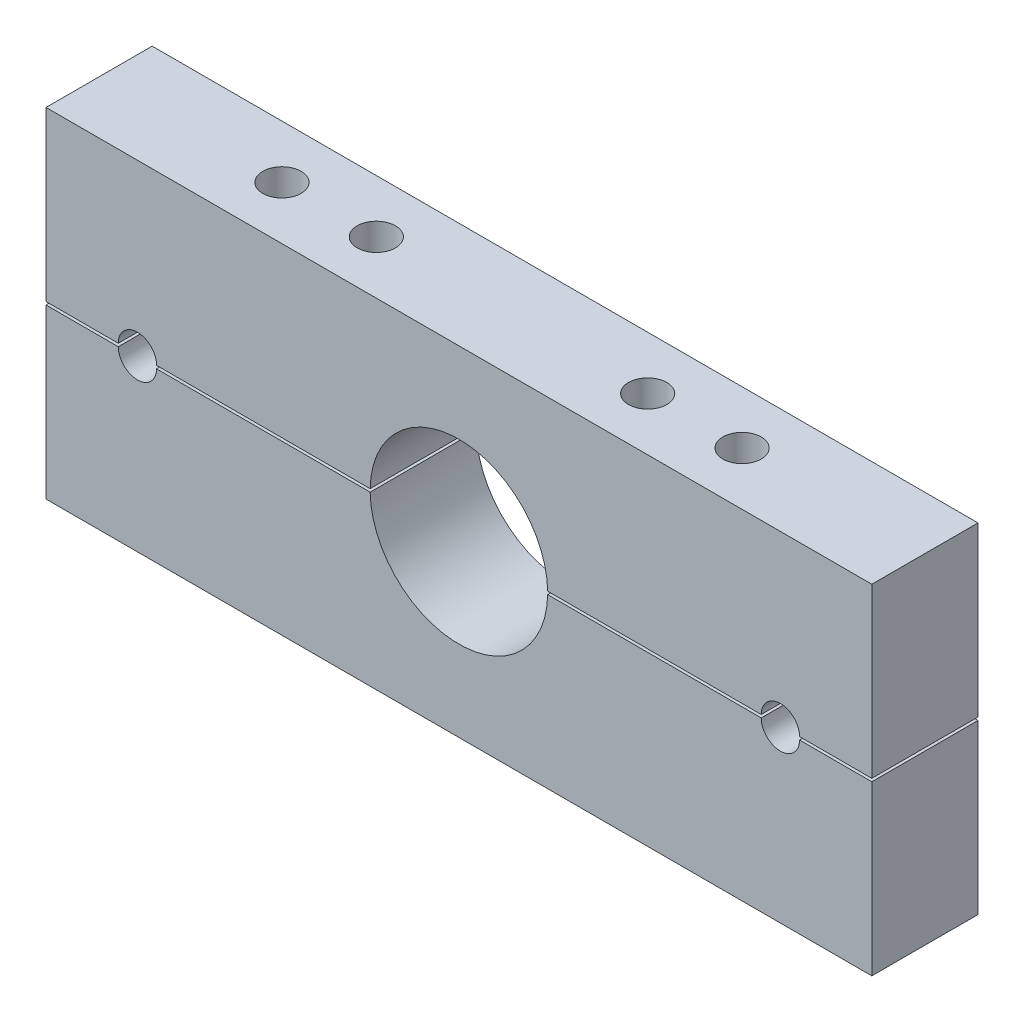
ISO-10303-21;
HEADER;
FILE_DESCRIPTION(('STEP AP214'),'2;1');
FILE_NAME('part.step','',(''),(''),'','','');
FILE_SCHEMA(('AUTOMOTIVE_DESIGN { 1 0 10303 214 1 1 1 1 }'));
ENDSEC;
DATA;
#1=APPLICATION_CONTEXT('core data for automotive mechanical design processes');
#2=APPLICATION_PROTOCOL_DEFINITION('international standard','automotive_design',2000,#1);
#3=PRODUCT_CONTEXT('',#1,'mechanical');
#4=PRODUCT('Part','Part','',(#3));
#5=PRODUCT_RELATED_PRODUCT_CATEGORY('part','',(#4));
#6=PRODUCT_DEFINITION_FORMATION('','',#4);
#7=PRODUCT_DEFINITION_CONTEXT('part definition',#1,'design');
#8=PRODUCT_DEFINITION('design','',#6,#7);
#9=PRODUCT_DEFINITION_SHAPE('','',#8);
#10=(LENGTH_UNIT() NAMED_UNIT(*) SI_UNIT(.MILLI.,.METRE.));
#11=(NAMED_UNIT(*) PLANE_ANGLE_UNIT() SI_UNIT($,.RADIAN.));
#12=(NAMED_UNIT(*) SI_UNIT($,.STERADIAN.) SOLID_ANGLE_UNIT());
#13=UNCERTAINTY_MEASURE_WITH_UNIT(LENGTH_MEASURE(1.E-05),#10,'distance_accuracy_value','');
#14=(GEOMETRIC_REPRESENTATION_CONTEXT(3) GLOBAL_UNCERTAINTY_ASSIGNED_CONTEXT((#13)) GLOBAL_UNIT_ASSIGNED_CONTEXT((#10,
#11,#12)) REPRESENTATION_CONTEXT('',''));
#15=CARTESIAN_POINT('',(0.,0.,0.));
#16=DIRECTION('',(0.,0.,1.));
#17=DIRECTION('',(1.,0.,0.));
#18=AXIS2_PLACEMENT_3D('',#15,#16,#17);
#19=CARTESIAN_POINT('',(267.829500207352,-141.519656459711,0.));
#20=DIRECTION('',(0.,1.,0.));
#21=DIRECTION('',(-1.,0.,0.));
#22=AXIS2_PLACEMENT_3D('',#19,#20,#21);
#23=PLANE('',#22);
#24=CARTESIAN_POINT('',(205.829500207352,-141.519656459711,18.));
#25=DIRECTION('',(0.,1.,0.));
#26=DIRECTION('',(-1.,0.,0.));
#27=AXIS2_PLACEMENT_3D('',#24,#25,#26);
#28=CIRCLE('',#27,6.50000000000002);
#29=CARTESIAN_POINT('',(199.329500207352,-141.519656459711,18.));
#30=VERTEX_POINT('',#29);
#31=EDGE_CURVE('E242',#30,#30,#28,.F.);
#32=ORIENTED_EDGE('',*,*,#31,.F.);
#33=EDGE_LOOP('',(#32));
#34=FACE_BOUND('',#33,.T.);
#35=CARTESIAN_POINT('',(173.829500207352,-141.519656459711,18.));
#36=DIRECTION('',(0.,1.,0.));
#37=DIRECTION('',(-1.,0.,0.));
#38=AXIS2_PLACEMENT_3D('',#35,#36,#37);
#39=CIRCLE('',#38,6.50000000000002);
#40=CARTESIAN_POINT('',(167.329500207352,-141.519656459711,18.));
#41=VERTEX_POINT('',#40);
#42=EDGE_CURVE('E257',#41,#41,#39,.F.);
#43=ORIENTED_EDGE('',*,*,#42,.F.);
#44=EDGE_LOOP('',(#43));
#45=FACE_BOUND('',#44,.T.);
#46=DIRECTION('',(-1.,0.,0.));
#47=VECTOR('',#46,1.);
#48=CARTESIAN_POINT('',(267.829500207352,-141.519656459711,0.));
#49=LINE('',#48,#47);
#50=CARTESIAN_POINT('',(230.329500207352,-141.519656459711,0.));
#51=VERTEX_POINT('',#50);
#52=CARTESIAN_POINT('',(157.925347096914,-141.519656459711,0.));
#53=VERTEX_POINT('',#52);
#54=EDGE_CURVE('E157',#51,#53,#49,.T.);
#55=ORIENTED_EDGE('',*,*,#54,.F.);
#56=DIRECTION('',(0.,0.,1.));
#57=VECTOR('',#56,1.);
#58=CARTESIAN_POINT('',(230.329500207352,-141.519656459711,0.));
#59=LINE('',#58,#57);
#60=CARTESIAN_POINT('',(230.329500207352,-141.519656459711,36.));
#61=VERTEX_POINT('',#60);
#62=EDGE_CURVE('E282',#51,#61,#59,.T.);
#63=ORIENTED_EDGE('',*,*,#62,.T.);
#64=DIRECTION('',(-1.,0.,0.));
#65=VECTOR('',#64,1.);
#66=CARTESIAN_POINT('',(267.829500207352,-141.519656459711,36.));
#67=LINE('',#66,#65);
#68=CARTESIAN_POINT('',(157.925347096914,-141.519656459711,36.));
#69=VERTEX_POINT('',#68);
#70=EDGE_CURVE('E213',#61,#69,#67,.T.);
#71=ORIENTED_EDGE('',*,*,#70,.T.);
#72=DIRECTION('',(0.,0.,-1.));
#73=VECTOR('',#72,1.);
#74=CARTESIAN_POINT('',(157.925347096914,-141.519656459711,36.));
#75=LINE('',#74,#73);
#76=EDGE_CURVE('E219',#69,#53,#75,.T.);
#77=ORIENTED_EDGE('',*,*,#76,.T.);
#78=EDGE_LOOP('',(#55,#63,#71,#77));
#79=FACE_BOUND('',#78,.T.);
#80=ADVANCED_FACE('F54',(#34,#45,#79),#23,.F.);
#81=CARTESIAN_POINT('',(12.3295002073518,-141.519656459711,0.));
#82=VERTEX_POINT('',#81);
#83=CARTESIAN_POINT('',(-12.1704997926482,-141.519656459711,0.));
#84=VERTEX_POINT('',#83);
#85=EDGE_CURVE('E147',#82,#84,#49,.T.);
#86=ORIENTED_EDGE('',*,*,#85,.F.);
#87=DIRECTION('',(0.,0.,1.));
#88=VECTOR('',#87,1.);
#89=CARTESIAN_POINT('',(12.3295002073518,-141.519656459711,0.));
#90=LINE('',#89,#88);
#91=CARTESIAN_POINT('',(12.3295002073518,-141.519656459711,36.));
#92=VERTEX_POINT('',#91);
#93=EDGE_CURVE('E132',#82,#92,#90,.T.);
#94=ORIENTED_EDGE('',*,*,#93,.T.);
#95=CARTESIAN_POINT('',(-12.1704997926482,-141.519656459711,36.));
#96=VERTEX_POINT('',#95);
#97=EDGE_CURVE('E217',#92,#96,#67,.T.);
#98=ORIENTED_EDGE('',*,*,#97,.T.);
#99=DIRECTION('',(0.,0.,-1.));
#100=VECTOR('',#99,1.);
#101=CARTESIAN_POINT('',(-12.1704997926482,-141.519656459711,0.));
#102=LINE('',#101,#100);
#103=EDGE_CURVE('E13',#96,#84,#102,.T.);
#104=ORIENTED_EDGE('',*,*,#103,.T.);
#105=EDGE_LOOP('',(#86,#94,#98,#104));
#106=FACE_BOUND('',#105,.T.);
#107=ADVANCED_FACE('F152',(#106),#23,.F.);
#108=CARTESIAN_POINT('',(127.829500207352,-142.019656459711,36.));
#109=DIRECTION('',(0.,0.,-1.));
#110=DIRECTION('',(-1.,0.,0.));
#111=AXIS2_PLACEMENT_3D('',#108,#109,#110);
#112=CYLINDRICAL_SURFACE('',#111,30.1);
#113=ORIENTED_EDGE('',*,*,#76,.F.);
#114=CARTESIAN_POINT('',(127.829500207352,-142.019656459711,36.));
#115=DIRECTION('',(0.,0.,1.));
#116=DIRECTION('',(1.,0.,0.));
#117=AXIS2_PLACEMENT_3D('',#114,#115,#116);
#118=CIRCLE('',#117,30.1);
#119=CARTESIAN_POINT('',(97.7336533177891,-141.519656459711,36.));
#120=VERTEX_POINT('',#119);
#121=EDGE_CURVE('E140',#69,#120,#118,.T.);
#122=ORIENTED_EDGE('',*,*,#121,.T.);
#123=DIRECTION('',(0.,0.,-1.));
#124=VECTOR('',#123,1.);
#125=CARTESIAN_POINT('',(97.7336533177891,-141.519656459711,36.));
#126=LINE('',#125,#124);
#127=CARTESIAN_POINT('',(97.7336533177891,-141.519656459711,0.));
#128=VERTEX_POINT('',#127);
#129=EDGE_CURVE('E212',#128,#120,#126,.F.);
#130=ORIENTED_EDGE('',*,*,#129,.F.);
#131=CARTESIAN_POINT('',(127.829500207352,-142.019656459711,0.));
#132=DIRECTION('',(0.,0.,1.));
#133=DIRECTION('',(1.,0.,0.));
#134=AXIS2_PLACEMENT_3D('',#131,#132,#133);
#135=CIRCLE('',#134,30.1);
#136=EDGE_CURVE('E58',#53,#128,#135,.T.);
#137=ORIENTED_EDGE('',*,*,#136,.F.);
#138=EDGE_LOOP('',(#113,#122,#130,#137));
#139=FACE_BOUND('',#138,.T.);
#140=ADVANCED_FACE('F288',(#139),#112,.F.);
#141=CARTESIAN_POINT('',(267.829500207352,0.,36.));
#142=DIRECTION('',(1.,0.,0.));
#143=DIRECTION('',(0.,0.,-1.));
#144=AXIS2_PLACEMENT_3D('',#141,#142,#143);
#145=PLANE('',#144);
#146=DIRECTION('',(0.,0.,-1.));
#147=VECTOR('',#146,1.);
#148=CARTESIAN_POINT('',(267.829500207352,-141.519656459711,0.));
#149=LINE('',#148,#147);
#150=CARTESIAN_POINT('',(267.829500207352,-141.519656459711,36.));
#151=VERTEX_POINT('',#150);
#152=CARTESIAN_POINT('',(267.829500207352,-141.519656459711,0.));
#153=VERTEX_POINT('',#152);
#154=EDGE_CURVE('E189',#151,#153,#149,.T.);
#155=ORIENTED_EDGE('',*,*,#154,.T.);
#156=DIRECTION('',(0.,-1.,0.));
#157=VECTOR('',#156,1.);
#158=CARTESIAN_POINT('',(267.829500207352,0.,0.));
#159=LINE('',#158,#157);
#160=CARTESIAN_POINT('',(267.829500207352,-84.5196564597115,0.));
#161=VERTEX_POINT('',#160);
#162=EDGE_CURVE('E165',#161,#153,#159,.T.);
#163=ORIENTED_EDGE('',*,*,#162,.F.);
#164=DIRECTION('',(0.,0.,-1.));
#165=VECTOR('',#164,1.);
#166=CARTESIAN_POINT('',(267.829500207352,-84.5196564597115,36.));
#167=LINE('',#166,#165);
#168=CARTESIAN_POINT('',(267.829500207352,-84.5196564597115,36.));
#169=VERTEX_POINT('',#168);
#170=EDGE_CURVE('E234',#169,#161,#167,.T.);
#171=ORIENTED_EDGE('',*,*,#170,.F.);
#172=DIRECTION('',(0.,-1.,0.));
#173=VECTOR('',#172,1.);
#174=CARTESIAN_POINT('',(267.829500207352,0.,36.));
#175=LINE('',#174,#173);
#176=EDGE_CURVE('E185',#169,#151,#175,.T.);
#177=ORIENTED_EDGE('',*,*,#176,.T.);
#178=EDGE_LOOP('',(#155,#163,#171,#177));
#179=FACE_BOUND('',#178,.T.);
#180=ADVANCED_FACE('F197',(#179),#145,.T.);
#181=CARTESIAN_POINT('',(-12.1704997926482,0.,36.));
#182=DIRECTION('',(1.,0.,0.));
#183=DIRECTION('',(0.,1.,0.));
#184=AXIS2_PLACEMENT_3D('',#181,#182,#183);
#185=PLANE('',#184);
#186=DIRECTION('',(0.,-1.,0.));
#187=VECTOR('',#186,1.);
#188=CARTESIAN_POINT('',(-12.1704997926482,0.,0.));
#189=LINE('',#188,#187);
#190=CARTESIAN_POINT('',(-12.1704997926482,-84.5196564597115,0.));
#191=VERTEX_POINT('',#190);
#192=EDGE_CURVE('E182',#191,#84,#189,.T.);
#193=ORIENTED_EDGE('',*,*,#192,.T.);
#194=ORIENTED_EDGE('',*,*,#103,.F.);
#195=DIRECTION('',(0.,-1.,0.));
#196=VECTOR('',#195,1.);
#197=CARTESIAN_POINT('',(-12.1704997926482,0.,36.));
#198=LINE('',#197,#196);
#199=CARTESIAN_POINT('',(-12.1704997926482,-84.5196564597115,36.));
#200=VERTEX_POINT('',#199);
#201=EDGE_CURVE('E173',#200,#96,#198,.T.);
#202=ORIENTED_EDGE('',*,*,#201,.F.);
#203=DIRECTION('',(0.,0.,-1.));
#204=VECTOR('',#203,1.);
#205=CARTESIAN_POINT('',(-12.1704997926482,-84.5196564597115,36.));
#206=LINE('',#205,#204);
#207=EDGE_CURVE('E179',#200,#191,#206,.T.);
#208=ORIENTED_EDGE('',*,*,#207,.T.);
#209=EDGE_LOOP('',(#193,#194,#202,#208));
#210=FACE_BOUND('',#209,.T.);
#211=ADVANCED_FACE('F230',(#210),#185,.F.);
#212=CARTESIAN_POINT('',(0.,0.,36.));
#213=DIRECTION('',(0.,0.,1.));
#214=DIRECTION('',(1.,0.,0.));
#215=AXIS2_PLACEMENT_3D('',#212,#213,#214);
#216=PLANE('',#215);
#217=CARTESIAN_POINT('',(18.8295002073518,-141.519656459711,36.));
#218=DIRECTION('',(0.,0.,1.));
#219=DIRECTION('',(1.,0.,0.));
#220=AXIS2_PLACEMENT_3D('',#217,#218,#219);
#221=CIRCLE('',#220,6.5);
#222=CARTESIAN_POINT('',(25.3295002073518,-141.519656459711,36.));
#223=VERTEX_POINT('',#222);
#224=EDGE_CURVE('E135',#223,#92,#221,.T.);
#225=ORIENTED_EDGE('',*,*,#224,.F.);
#226=EDGE_CURVE('E64',#120,#223,#67,.T.);
#227=ORIENTED_EDGE('',*,*,#226,.F.);
#228=ORIENTED_EDGE('',*,*,#121,.F.);
#229=ORIENTED_EDGE('',*,*,#70,.F.);
#230=CARTESIAN_POINT('',(236.829500207352,-141.519656459711,36.));
#231=DIRECTION('',(0.,0.,1.));
#232=DIRECTION('',(1.,0.,0.));
#233=AXIS2_PLACEMENT_3D('',#230,#231,#232);
#234=CIRCLE('',#233,6.50000000000001);
#235=CARTESIAN_POINT('',(243.329500207352,-141.519656459711,36.));
#236=VERTEX_POINT('',#235);
#237=EDGE_CURVE('E210',#236,#61,#234,.T.);
#238=ORIENTED_EDGE('',*,*,#237,.F.);
#239=EDGE_CURVE('E203',#151,#236,#67,.T.);
#240=ORIENTED_EDGE('',*,*,#239,.F.);
#241=ORIENTED_EDGE('',*,*,#176,.F.);
#242=DIRECTION('',(1.,0.,0.));
#243=VECTOR('',#242,1.);
#244=CARTESIAN_POINT('',(0.,-84.5196564597115,36.));
#245=LINE('',#244,#243);
#246=EDGE_CURVE('E231',#200,#169,#245,.T.);
#247=ORIENTED_EDGE('',*,*,#246,.F.);
#248=ORIENTED_EDGE('',*,*,#201,.T.);
#249=ORIENTED_EDGE('',*,*,#97,.F.);
#250=EDGE_LOOP('',(#225,#227,#228,#229,#238,#240,#241,#247,#248,#249));
#251=FACE_BOUND('',#250,.T.);
#252=ADVANCED_FACE('F206',(#251),#216,.T.);
#253=CARTESIAN_POINT('',(0.,0.,0.));
#254=DIRECTION('',(0.,0.,1.));
#255=DIRECTION('',(1.,0.,0.));
#256=AXIS2_PLACEMENT_3D('',#253,#254,#255);
#257=PLANE('',#256);
#258=CARTESIAN_POINT('',(25.3295002073518,-141.519656459711,0.));
#259=VERTEX_POINT('',#258);
#260=EDGE_CURVE('E149',#128,#259,#49,.T.);
#261=ORIENTED_EDGE('',*,*,#260,.T.);
#262=CARTESIAN_POINT('',(18.8295002073518,-141.519656459711,0.));
#263=DIRECTION('',(0.,0.,1.));
#264=DIRECTION('',(1.,0.,0.));
#265=AXIS2_PLACEMENT_3D('',#262,#263,#264);
#266=CIRCLE('',#265,6.5);
#267=EDGE_CURVE('E80',#259,#82,#266,.T.);
#268=ORIENTED_EDGE('',*,*,#267,.T.);
#269=ORIENTED_EDGE('',*,*,#85,.T.);
#270=ORIENTED_EDGE('',*,*,#192,.F.);
#271=DIRECTION('',(1.,0.,0.));
#272=VECTOR('',#271,1.);
#273=CARTESIAN_POINT('',(0.,-84.5196564597115,0.));
#274=LINE('',#273,#272);
#275=EDGE_CURVE('E161',#191,#161,#274,.T.);
#276=ORIENTED_EDGE('',*,*,#275,.T.);
#277=ORIENTED_EDGE('',*,*,#162,.T.);
#278=CARTESIAN_POINT('',(243.329500207352,-141.519656459711,0.));
#279=VERTEX_POINT('',#278);
#280=EDGE_CURVE('E162',#153,#279,#49,.T.);
#281=ORIENTED_EDGE('',*,*,#280,.T.);
#282=CARTESIAN_POINT('',(236.829500207352,-141.519656459711,0.));
#283=DIRECTION('',(0.,0.,1.));
#284=DIRECTION('',(1.,0.,0.));
#285=AXIS2_PLACEMENT_3D('',#282,#283,#284);
#286=CIRCLE('',#285,6.50000000000001);
#287=EDGE_CURVE('E72',#279,#51,#286,.T.);
#288=ORIENTED_EDGE('',*,*,#287,.T.);
#289=ORIENTED_EDGE('',*,*,#54,.T.);
#290=ORIENTED_EDGE('',*,*,#136,.T.);
#291=EDGE_LOOP('',(#261,#268,#269,#270,#276,#277,#281,#288,#289,#290));
#292=FACE_BOUND('',#291,.T.);
#293=ADVANCED_FACE('F145',(#292),#257,.F.);
#294=CARTESIAN_POINT('',(49.8295002073518,-142.019656459711,18.));
#295=DIRECTION('',(0.,1.,0.));
#296=DIRECTION('',(0.,0.,1.));
#297=AXIS2_PLACEMENT_3D('',#294,#295,#296);
#298=CYLINDRICAL_SURFACE('',#297,6.5);
#299=CARTESIAN_POINT('',(49.8295002073518,-141.519656459711,18.));
#300=DIRECTION('',(0.,1.,0.));
#301=DIRECTION('',(-1.,0.,0.));
#302=AXIS2_PLACEMENT_3D('',#299,#300,#301);
#303=CIRCLE('',#302,6.5);
#304=CARTESIAN_POINT('',(43.3295002073518,-141.519656459711,18.));
#305=VERTEX_POINT('',#304);
#306=EDGE_CURVE('E252',#305,#305,#303,.F.);
#307=ORIENTED_EDGE('',*,*,#306,.T.);
#308=EDGE_LOOP('',(#307));
#309=FACE_BOUND('',#308,.T.);
#310=CARTESIAN_POINT('',(49.8295002073518,-84.5196564597115,18.));
#311=DIRECTION('',(0.,1.,0.));
#312=DIRECTION('',(0.,0.,1.));
#313=AXIS2_PLACEMENT_3D('',#310,#311,#312);
#314=CIRCLE('',#313,6.5);
#315=CARTESIAN_POINT('',(49.8295002073518,-84.5196564597115,24.5));
#316=VERTEX_POINT('',#315);
#317=EDGE_CURVE('E247',#316,#316,#314,.T.);
#318=ORIENTED_EDGE('',*,*,#317,.T.);
#319=EDGE_LOOP('',(#318));
#320=FACE_BOUND('',#319,.T.);
#321=ADVANCED_FACE('F335',(#309,#320),#298,.F.);
#322=CARTESIAN_POINT('',(81.8295002073518,-142.019656459711,18.));
#323=DIRECTION('',(0.,1.,0.));
#324=DIRECTION('',(0.,0.,1.));
#325=AXIS2_PLACEMENT_3D('',#322,#323,#324);
#326=CYLINDRICAL_SURFACE('',#325,6.5);
#327=CARTESIAN_POINT('',(81.8295002073518,-141.519656459711,18.));
#328=DIRECTION('',(0.,1.,0.));
#329=DIRECTION('',(-1.,0.,0.));
#330=AXIS2_PLACEMENT_3D('',#327,#328,#329);
#331=CIRCLE('',#330,6.5);
#332=CARTESIAN_POINT('',(75.3295002073518,-141.519656459711,18.));
#333=VERTEX_POINT('',#332);
#334=EDGE_CURVE('E251',#333,#333,#331,.F.);
#335=ORIENTED_EDGE('',*,*,#334,.T.);
#336=EDGE_LOOP('',(#335));
#337=FACE_BOUND('',#336,.T.);
#338=CARTESIAN_POINT('',(81.8295002073518,-84.5196564597115,18.));
#339=DIRECTION('',(0.,1.,0.));
#340=DIRECTION('',(0.,0.,1.));
#341=AXIS2_PLACEMENT_3D('',#338,#339,#340);
#342=CIRCLE('',#341,6.5);
#343=CARTESIAN_POINT('',(81.8295002073518,-84.5196564597115,24.5));
#344=VERTEX_POINT('',#343);
#345=EDGE_CURVE('E253',#344,#344,#342,.T.);
#346=ORIENTED_EDGE('',*,*,#345,.T.);
#347=EDGE_LOOP('',(#346));
#348=FACE_BOUND('',#347,.T.);
#349=ADVANCED_FACE('F346',(#337,#348),#326,.F.);
#350=CARTESIAN_POINT('',(173.829500207352,-142.019656459711,18.));
#351=DIRECTION('',(0.,1.,0.));
#352=DIRECTION('',(0.,0.,1.));
#353=AXIS2_PLACEMENT_3D('',#350,#351,#352);
#354=CYLINDRICAL_SURFACE('',#353,6.50000000000002);
#355=ORIENTED_EDGE('',*,*,#42,.T.);
#356=EDGE_LOOP('',(#355));
#357=FACE_BOUND('',#356,.T.);
#358=CARTESIAN_POINT('',(173.829500207352,-84.5196564597115,18.));
#359=DIRECTION('',(0.,1.,0.));
#360=DIRECTION('',(0.,0.,1.));
#361=AXIS2_PLACEMENT_3D('',#358,#359,#360);
#362=CIRCLE('',#361,6.50000000000002);
#363=CARTESIAN_POINT('',(173.829500207352,-84.5196564597115,24.5));
#364=VERTEX_POINT('',#363);
#365=EDGE_CURVE('E258',#364,#364,#362,.T.);
#366=ORIENTED_EDGE('',*,*,#365,.T.);
#367=EDGE_LOOP('',(#366));
#368=FACE_BOUND('',#367,.T.);
#369=ADVANCED_FACE('F274',(#357,#368),#354,.F.);
#370=CARTESIAN_POINT('',(205.829500207352,-142.019656459711,18.));
#371=DIRECTION('',(0.,1.,0.));
#372=DIRECTION('',(0.,0.,1.));
#373=AXIS2_PLACEMENT_3D('',#370,#371,#372);
#374=CYLINDRICAL_SURFACE('',#373,6.50000000000002);
#375=ORIENTED_EDGE('',*,*,#31,.T.);
#376=EDGE_LOOP('',(#375));
#377=FACE_BOUND('',#376,.T.);
#378=CARTESIAN_POINT('',(205.829500207352,-84.5196564597115,18.));
#379=DIRECTION('',(0.,1.,0.));
#380=DIRECTION('',(0.,0.,1.));
#381=AXIS2_PLACEMENT_3D('',#378,#379,#380);
#382=CIRCLE('',#381,6.50000000000002);
#383=CARTESIAN_POINT('',(205.829500207352,-84.5196564597115,24.5));
#384=VERTEX_POINT('',#383);
#385=EDGE_CURVE('E235',#384,#384,#382,.T.);
#386=ORIENTED_EDGE('',*,*,#385,.T.);
#387=EDGE_LOOP('',(#386));
#388=FACE_BOUND('',#387,.T.);
#389=ADVANCED_FACE('F56',(#377,#388),#374,.F.);
#390=CARTESIAN_POINT('',(0.,-84.5196564597115,36.));
#391=DIRECTION('',(0.,1.,0.));
#392=DIRECTION('',(0.,0.,1.));
#393=AXIS2_PLACEMENT_3D('',#390,#391,#392);
#394=PLANE('',#393);
#395=ORIENTED_EDGE('',*,*,#385,.F.);
#396=EDGE_LOOP('',(#395));
#397=FACE_BOUND('',#396,.T.);
#398=ORIENTED_EDGE('',*,*,#365,.F.);
#399=EDGE_LOOP('',(#398));
#400=FACE_BOUND('',#399,.T.);
#401=ORIENTED_EDGE('',*,*,#345,.F.);
#402=EDGE_LOOP('',(#401));
#403=FACE_BOUND('',#402,.T.);
#404=ORIENTED_EDGE('',*,*,#317,.F.);
#405=EDGE_LOOP('',(#404));
#406=FACE_BOUND('',#405,.T.);
#407=ORIENTED_EDGE('',*,*,#275,.F.);
#408=ORIENTED_EDGE('',*,*,#207,.F.);
#409=ORIENTED_EDGE('',*,*,#246,.T.);
#410=ORIENTED_EDGE('',*,*,#170,.T.);
#411=EDGE_LOOP('',(#407,#408,#409,#410));
#412=FACE_BOUND('',#411,.T.);
#413=ADVANCED_FACE('F311',(#397,#400,#403,#406,#412),#394,.T.);
#414=ORIENTED_EDGE('',*,*,#239,.T.);
#415=DIRECTION('',(0.,0.,1.));
#416=VECTOR('',#415,1.);
#417=CARTESIAN_POINT('',(243.329500207352,-141.519656459711,0.));
#418=LINE('',#417,#416);
#419=EDGE_CURVE('E295',#279,#236,#418,.T.);
#420=ORIENTED_EDGE('',*,*,#419,.F.);
#421=ORIENTED_EDGE('',*,*,#280,.F.);
#422=ORIENTED_EDGE('',*,*,#154,.F.);
#423=EDGE_LOOP('',(#414,#420,#421,#422));
#424=FACE_BOUND('',#423,.T.);
#425=ADVANCED_FACE('F202',(#424),#23,.F.);
#426=ORIENTED_EDGE('',*,*,#226,.T.);
#427=DIRECTION('',(0.,0.,1.));
#428=VECTOR('',#427,1.);
#429=CARTESIAN_POINT('',(25.3295002073518,-141.519656459711,0.));
#430=LINE('',#429,#428);
#431=EDGE_CURVE('E141',#259,#223,#430,.T.);
#432=ORIENTED_EDGE('',*,*,#431,.F.);
#433=ORIENTED_EDGE('',*,*,#260,.F.);
#434=ORIENTED_EDGE('',*,*,#129,.T.);
#435=EDGE_LOOP('',(#426,#432,#433,#434));
#436=FACE_BOUND('',#435,.T.);
#437=ORIENTED_EDGE('',*,*,#334,.F.);
#438=EDGE_LOOP('',(#437));
#439=FACE_BOUND('',#438,.T.);
#440=ORIENTED_EDGE('',*,*,#306,.F.);
#441=EDGE_LOOP('',(#440));
#442=FACE_BOUND('',#441,.T.);
#443=ADVANCED_FACE('F289',(#436,#439,#442),#23,.F.);
#444=CARTESIAN_POINT('',(18.8295002073518,-141.519656459711,0.));
#445=DIRECTION('',(0.,0.,1.));
#446=DIRECTION('',(1.,0.,0.));
#447=AXIS2_PLACEMENT_3D('',#444,#445,#446);
#448=CYLINDRICAL_SURFACE('',#447,6.5);
#449=ORIENTED_EDGE('',*,*,#224,.T.);
#450=ORIENTED_EDGE('',*,*,#93,.F.);
#451=ORIENTED_EDGE('',*,*,#267,.F.);
#452=ORIENTED_EDGE('',*,*,#431,.T.);
#453=EDGE_LOOP('',(#449,#450,#451,#452));
#454=FACE_BOUND('',#453,.T.);
#455=ADVANCED_FACE('F133',(#454),#448,.F.);
#456=CARTESIAN_POINT('',(236.829500207352,-141.519656459711,0.));
#457=DIRECTION('',(0.,0.,1.));
#458=DIRECTION('',(1.,0.,0.));
#459=AXIS2_PLACEMENT_3D('',#456,#457,#458);
#460=CYLINDRICAL_SURFACE('',#459,6.50000000000001);
#461=ORIENTED_EDGE('',*,*,#237,.T.);
#462=ORIENTED_EDGE('',*,*,#62,.F.);
#463=ORIENTED_EDGE('',*,*,#287,.F.);
#464=ORIENTED_EDGE('',*,*,#419,.T.);
#465=EDGE_LOOP('',(#461,#462,#463,#464));
#466=FACE_BOUND('',#465,.T.);
#467=ADVANCED_FACE('F330',(#466),#460,.F.);
#468=CLOSED_SHELL('',(#80,#107,#140,#180,#211,#252,#293,#321,#349,#369,#389,#413,#425,#443,#455,#467));
#469=MANIFOLD_SOLID_BREP('B2',#468);
#470=CARTESIAN_POINT('',(267.829500207352,-142.519656459711,0.));
#471=DIRECTION('',(0.,-1.,0.));
#472=DIRECTION('',(1.,0.,0.));
#473=AXIS2_PLACEMENT_3D('',#470,#471,#472);
#474=PLANE('',#473);
#475=DIRECTION('',(-1.,0.,0.));
#476=VECTOR('',#475,1.);
#477=CARTESIAN_POINT('',(267.829500207352,-142.519656459711,0.));
#478=LINE('',#477,#476);
#479=CARTESIAN_POINT('',(267.829500207352,-142.519656459711,0.));
#480=VERTEX_POINT('',#479);
#481=CARTESIAN_POINT('',(243.329500207352,-142.519656459711,0.));
#482=VERTEX_POINT('',#481);
#483=EDGE_CURVE('E673',#480,#482,#478,.T.);
#484=ORIENTED_EDGE('',*,*,#483,.T.);
#485=DIRECTION('',(0.,0.,1.));
#486=VECTOR('',#485,1.);
#487=CARTESIAN_POINT('',(243.329500207352,-142.519656459711,0.));
#488=LINE('',#487,#486);
#489=CARTESIAN_POINT('',(243.329500207352,-142.519656459711,36.));
#490=VERTEX_POINT('',#489);
#491=EDGE_CURVE('E830',#482,#490,#488,.T.);
#492=ORIENTED_EDGE('',*,*,#491,.T.);
#493=DIRECTION('',(-1.,0.,0.));
#494=VECTOR('',#493,1.);
#495=CARTESIAN_POINT('',(267.829500207352,-142.519656459711,36.));
#496=LINE('',#495,#494);
#497=CARTESIAN_POINT('',(267.829500207352,-142.519656459711,36.));
#498=VERTEX_POINT('',#497);
#499=EDGE_CURVE('E695',#498,#490,#496,.T.);
#500=ORIENTED_EDGE('',*,*,#499,.F.);
#501=DIRECTION('',(0.,0.,1.));
#502=VECTOR('',#501,1.);
#503=CARTESIAN_POINT('',(267.829500207352,-142.519656459711,0.));
#504=LINE('',#503,#502);
#505=EDGE_CURVE('E677',#480,#498,#504,.T.);
#506=ORIENTED_EDGE('',*,*,#505,.F.);
#507=EDGE_LOOP('',(#484,#492,#500,#506));
#508=FACE_BOUND('',#507,.T.);
#509=ADVANCED_FACE('F568',(#508),#474,.F.);
#510=CARTESIAN_POINT('',(81.8295002073518,-142.519656459711,18.));
#511=DIRECTION('',(0.,-1.,0.));
#512=DIRECTION('',(1.,0.,0.));
#513=AXIS2_PLACEMENT_3D('',#510,#511,#512);
#514=CIRCLE('',#513,6.5);
#515=CARTESIAN_POINT('',(88.3295002073518,-142.519656459711,18.));
#516=VERTEX_POINT('',#515);
#517=EDGE_CURVE('E715',#516,#516,#514,.F.);
#518=ORIENTED_EDGE('',*,*,#517,.F.);
#519=EDGE_LOOP('',(#518));
#520=FACE_BOUND('',#519,.T.);
#521=CARTESIAN_POINT('',(49.8295002073518,-142.519656459711,18.));
#522=DIRECTION('',(0.,-1.,0.));
#523=DIRECTION('',(1.,0.,0.));
#524=AXIS2_PLACEMENT_3D('',#521,#522,#523);
#525=CIRCLE('',#524,6.5);
#526=CARTESIAN_POINT('',(56.3295002073518,-142.519656459711,18.));
#527=VERTEX_POINT('',#526);
#528=EDGE_CURVE('E721',#527,#527,#525,.F.);
#529=ORIENTED_EDGE('',*,*,#528,.F.);
#530=EDGE_LOOP('',(#529));
#531=FACE_BOUND('',#530,.T.);
#532=CARTESIAN_POINT('',(97.7336533177891,-142.519656459711,0.));
#533=VERTEX_POINT('',#532);
#534=CARTESIAN_POINT('',(25.3295002073518,-142.519656459711,0.));
#535=VERTEX_POINT('',#534);
#536=EDGE_CURVE('E661',#533,#535,#478,.T.);
#537=ORIENTED_EDGE('',*,*,#536,.T.);
#538=DIRECTION('',(0.,0.,1.));
#539=VECTOR('',#538,1.);
#540=CARTESIAN_POINT('',(25.3295002073518,-142.519656459711,0.));
#541=LINE('',#540,#539);
#542=CARTESIAN_POINT('',(25.3295002073518,-142.519656459711,36.));
#543=VERTEX_POINT('',#542);
#544=EDGE_CURVE('E645',#535,#543,#541,.T.);
#545=ORIENTED_EDGE('',*,*,#544,.T.);
#546=CARTESIAN_POINT('',(97.7336533177891,-142.519656459711,36.));
#547=VERTEX_POINT('',#546);
#548=EDGE_CURVE('E688',#547,#543,#496,.T.);
#549=ORIENTED_EDGE('',*,*,#548,.F.);
#550=DIRECTION('',(0.,0.,-1.));
#551=VECTOR('',#550,1.);
#552=CARTESIAN_POINT('',(97.7336533177891,-142.519656459711,36.));
#553=LINE('',#552,#551);
#554=EDGE_CURVE('E669',#547,#533,#553,.T.);
#555=ORIENTED_EDGE('',*,*,#554,.T.);
#556=EDGE_LOOP('',(#537,#545,#549,#555));
#557=FACE_BOUND('',#556,.T.);
#558=ADVANCED_FACE('F667',(#520,#531,#557),#474,.F.);
#559=CARTESIAN_POINT('',(0.,0.,0.));
#560=DIRECTION('',(0.,0.,1.));
#561=DIRECTION('',(1.,0.,0.));
#562=AXIS2_PLACEMENT_3D('',#559,#560,#561);
#563=PLANE('',#562);
#564=CARTESIAN_POINT('',(12.3295002073518,-142.519656459711,0.));
#565=VERTEX_POINT('',#564);
#566=CARTESIAN_POINT('',(-12.1704997926482,-142.519656459711,0.));
#567=VERTEX_POINT('',#566);
#568=EDGE_CURVE('E664',#565,#567,#478,.T.);
#569=ORIENTED_EDGE('',*,*,#568,.F.);
#570=CARTESIAN_POINT('',(18.8295002073518,-142.519656459711,0.));
#571=DIRECTION('',(0.,0.,1.));
#572=DIRECTION('',(1.,0.,0.));
#573=AXIS2_PLACEMENT_3D('',#570,#571,#572);
#574=CIRCLE('',#573,6.5);
#575=EDGE_CURVE('E594',#565,#535,#574,.T.);
#576=ORIENTED_EDGE('',*,*,#575,.T.);
#577=ORIENTED_EDGE('',*,*,#536,.F.);
#578=CARTESIAN_POINT('',(127.829500207352,-142.019656459711,0.));
#579=DIRECTION('',(0.,0.,1.));
#580=DIRECTION('',(1.,0.,0.));
#581=AXIS2_PLACEMENT_3D('',#578,#579,#580);
#582=CIRCLE('',#581,30.1);
#583=CARTESIAN_POINT('',(157.925347096914,-142.519656459711,0.));
#584=VERTEX_POINT('',#583);
#585=EDGE_CURVE('E764',#533,#584,#582,.T.);
#586=ORIENTED_EDGE('',*,*,#585,.T.);
#587=CARTESIAN_POINT('',(230.329500207352,-142.519656459711,0.));
#588=VERTEX_POINT('',#587);
#589=EDGE_CURVE('E671',#588,#584,#478,.T.);
#590=ORIENTED_EDGE('',*,*,#589,.F.);
#591=CARTESIAN_POINT('',(236.829500207352,-142.519656459711,0.));
#592=DIRECTION('',(0.,0.,1.));
#593=DIRECTION('',(1.,0.,0.));
#594=AXIS2_PLACEMENT_3D('',#591,#592,#593);
#595=CIRCLE('',#594,6.50000000000001);
#596=EDGE_CURVE('E586',#588,#482,#595,.T.);
#597=ORIENTED_EDGE('',*,*,#596,.T.);
#598=ORIENTED_EDGE('',*,*,#483,.F.);
#599=DIRECTION('',(0.,-1.,0.));
#600=VECTOR('',#599,1.);
#601=CARTESIAN_POINT('',(267.829500207352,0.,0.));
#602=LINE('',#601,#600);
#603=CARTESIAN_POINT('',(267.829500207352,-199.519656459711,0.));
#604=VERTEX_POINT('',#603);
#605=EDGE_CURVE('E774',#480,#604,#602,.T.);
#606=ORIENTED_EDGE('',*,*,#605,.T.);
#607=DIRECTION('',(1.,0.,0.));
#608=VECTOR('',#607,1.);
#609=CARTESIAN_POINT('',(0.,-199.519656459711,0.));
#610=LINE('',#609,#608);
#611=CARTESIAN_POINT('',(-12.1704997926482,-199.519656459711,0.));
#612=VERTEX_POINT('',#611);
#613=EDGE_CURVE('E737',#612,#604,#610,.T.);
#614=ORIENTED_EDGE('',*,*,#613,.F.);
#615=DIRECTION('',(0.,-1.,0.));
#616=VECTOR('',#615,1.);
#617=CARTESIAN_POINT('',(-12.1704997926482,0.,0.));
#618=LINE('',#617,#616);
#619=EDGE_CURVE('E769',#567,#612,#618,.T.);
#620=ORIENTED_EDGE('',*,*,#619,.F.);
#621=EDGE_LOOP('',(#569,#576,#577,#586,#590,#597,#598,#606,#614,#620));
#622=FACE_BOUND('',#621,.T.);
#623=ADVANCED_FACE('F659',(#622),#563,.F.);
#624=CARTESIAN_POINT('',(0.,0.,36.));
#625=DIRECTION('',(0.,0.,1.));
#626=DIRECTION('',(1.,0.,0.));
#627=AXIS2_PLACEMENT_3D('',#624,#625,#626);
#628=PLANE('',#627);
#629=CARTESIAN_POINT('',(18.8295002073518,-142.519656459711,36.));
#630=DIRECTION('',(0.,0.,1.));
#631=DIRECTION('',(1.,0.,0.));
#632=AXIS2_PLACEMENT_3D('',#629,#630,#631);
#633=CIRCLE('',#632,6.5);
#634=CARTESIAN_POINT('',(12.3295002073518,-142.519656459711,36.));
#635=VERTEX_POINT('',#634);
#636=EDGE_CURVE('E648',#635,#543,#633,.T.);
#637=ORIENTED_EDGE('',*,*,#636,.F.);
#638=CARTESIAN_POINT('',(-12.1704997926482,-142.519656459711,36.));
#639=VERTEX_POINT('',#638);
#640=EDGE_CURVE('E682',#635,#639,#496,.T.);
#641=ORIENTED_EDGE('',*,*,#640,.T.);
#642=DIRECTION('',(0.,-1.,0.));
#643=VECTOR('',#642,1.);
#644=CARTESIAN_POINT('',(-12.1704997926482,0.,36.));
#645=LINE('',#644,#643);
#646=CARTESIAN_POINT('',(-12.1704997926482,-199.519656459711,36.));
#647=VERTEX_POINT('',#646);
#648=EDGE_CURVE('E52',#639,#647,#645,.T.);
#649=ORIENTED_EDGE('',*,*,#648,.T.);
#650=DIRECTION('',(1.,0.,0.));
#651=VECTOR('',#650,1.);
#652=CARTESIAN_POINT('',(0.,-199.519656459711,36.));
#653=LINE('',#652,#651);
#654=CARTESIAN_POINT('',(267.829500207352,-199.519656459711,36.));
#655=VERTEX_POINT('',#654);
#656=EDGE_CURVE('E749',#647,#655,#653,.T.);
#657=ORIENTED_EDGE('',*,*,#656,.T.);
#658=DIRECTION('',(0.,-1.,0.));
#659=VECTOR('',#658,1.);
#660=CARTESIAN_POINT('',(267.829500207352,0.,36.));
#661=LINE('',#660,#659);
#662=EDGE_CURVE('E578',#498,#655,#661,.T.);
#663=ORIENTED_EDGE('',*,*,#662,.F.);
#664=ORIENTED_EDGE('',*,*,#499,.T.);
#665=CARTESIAN_POINT('',(236.829500207352,-142.519656459711,36.));
#666=DIRECTION('',(0.,0.,1.));
#667=DIRECTION('',(1.,0.,0.));
#668=AXIS2_PLACEMENT_3D('',#665,#666,#667);
#669=CIRCLE('',#668,6.50000000000001);
#670=CARTESIAN_POINT('',(230.329500207352,-142.519656459711,36.));
#671=VERTEX_POINT('',#670);
#672=EDGE_CURVE('E833',#671,#490,#669,.T.);
#673=ORIENTED_EDGE('',*,*,#672,.F.);
#674=CARTESIAN_POINT('',(157.925347096914,-142.519656459711,36.));
#675=VERTEX_POINT('',#674);
#676=EDGE_CURVE('E689',#671,#675,#496,.T.);
#677=ORIENTED_EDGE('',*,*,#676,.T.);
#678=CARTESIAN_POINT('',(127.829500207352,-142.019656459711,36.));
#679=DIRECTION('',(0.,0.,1.));
#680=DIRECTION('',(1.,0.,0.));
#681=AXIS2_PLACEMENT_3D('',#678,#679,#680);
#682=CIRCLE('',#681,30.1);
#683=EDGE_CURVE('E765',#547,#675,#682,.T.);
#684=ORIENTED_EDGE('',*,*,#683,.F.);
#685=ORIENTED_EDGE('',*,*,#548,.T.);
#686=EDGE_LOOP('',(#637,#641,#649,#657,#663,#664,#673,#677,#684,#685));
#687=FACE_BOUND('',#686,.T.);
#688=ADVANCED_FACE('F792',(#687),#628,.T.);
#689=CARTESIAN_POINT('',(-12.1704997926482,0.,36.));
#690=DIRECTION('',(1.,0.,0.));
#691=DIRECTION('',(0.,1.,0.));
#692=AXIS2_PLACEMENT_3D('',#689,#690,#691);
#693=PLANE('',#692);
#694=ORIENTED_EDGE('',*,*,#648,.F.);
#695=DIRECTION('',(0.,0.,1.));
#696=VECTOR('',#695,1.);
#697=CARTESIAN_POINT('',(-12.1704997926482,-142.519656459711,0.));
#698=LINE('',#697,#696);
#699=EDGE_CURVE('E653',#567,#639,#698,.T.);
#700=ORIENTED_EDGE('',*,*,#699,.F.);
#701=ORIENTED_EDGE('',*,*,#619,.T.);
#702=DIRECTION('',(0.,0.,-1.));
#703=VECTOR('',#702,1.);
#704=CARTESIAN_POINT('',(-12.1704997926482,-199.519656459711,36.));
#705=LINE('',#704,#703);
#706=EDGE_CURVE('E760',#647,#612,#705,.T.);
#707=ORIENTED_EDGE('',*,*,#706,.F.);
#708=EDGE_LOOP('',(#694,#700,#701,#707));
#709=FACE_BOUND('',#708,.T.);
#710=ADVANCED_FACE('F782',(#709),#693,.F.);
#711=CARTESIAN_POINT('',(267.829500207352,0.,36.));
#712=DIRECTION('',(1.,0.,0.));
#713=DIRECTION('',(0.,0.,-1.));
#714=AXIS2_PLACEMENT_3D('',#711,#712,#713);
#715=PLANE('',#714);
#716=ORIENTED_EDGE('',*,*,#505,.T.);
#717=ORIENTED_EDGE('',*,*,#662,.T.);
#718=DIRECTION('',(0.,0.,-1.));
#719=VECTOR('',#718,1.);
#720=CARTESIAN_POINT('',(267.829500207352,-199.519656459711,36.));
#721=LINE('',#720,#719);
#722=EDGE_CURVE('E753',#655,#604,#721,.T.);
#723=ORIENTED_EDGE('',*,*,#722,.T.);
#724=ORIENTED_EDGE('',*,*,#605,.F.);
#725=EDGE_LOOP('',(#716,#717,#723,#724));
#726=FACE_BOUND('',#725,.T.);
#727=ADVANCED_FACE('F791',(#726),#715,.T.);
#728=CARTESIAN_POINT('',(127.829500207352,-142.019656459711,36.));
#729=DIRECTION('',(0.,0.,-1.));
#730=DIRECTION('',(-1.,0.,0.));
#731=AXIS2_PLACEMENT_3D('',#728,#729,#730);
#732=CYLINDRICAL_SURFACE('',#731,30.1);
#733=ORIENTED_EDGE('',*,*,#554,.F.);
#734=ORIENTED_EDGE('',*,*,#683,.T.);
#735=DIRECTION('',(0.,0.,-1.));
#736=VECTOR('',#735,1.);
#737=CARTESIAN_POINT('',(157.925347096914,-142.519656459711,36.));
#738=LINE('',#737,#736);
#739=EDGE_CURVE('E727',#584,#675,#738,.F.);
#740=ORIENTED_EDGE('',*,*,#739,.F.);
#741=ORIENTED_EDGE('',*,*,#585,.F.);
#742=EDGE_LOOP('',(#733,#734,#740,#741));
#743=FACE_BOUND('',#742,.T.);
#744=ADVANCED_FACE('F570',(#743),#732,.F.);
#745=CARTESIAN_POINT('',(49.8295002073518,-142.019656459711,18.));
#746=DIRECTION('',(0.,1.,0.));
#747=DIRECTION('',(0.,0.,1.));
#748=AXIS2_PLACEMENT_3D('',#745,#746,#747);
#749=CYLINDRICAL_SURFACE('',#748,6.5);
#750=ORIENTED_EDGE('',*,*,#528,.T.);
#751=EDGE_LOOP('',(#750));
#752=FACE_BOUND('',#751,.T.);
#753=CARTESIAN_POINT('',(49.8295002073518,-199.519656459711,18.));
#754=DIRECTION('',(0.,1.,0.));
#755=DIRECTION('',(0.,0.,1.));
#756=AXIS2_PLACEMENT_3D('',#753,#754,#755);
#757=CIRCLE('',#756,6.5);
#758=CARTESIAN_POINT('',(49.8295002073518,-199.519656459711,24.5));
#759=VERTEX_POINT('',#758);
#760=EDGE_CURVE('E732',#759,#759,#757,.T.);
#761=ORIENTED_EDGE('',*,*,#760,.F.);
#762=EDGE_LOOP('',(#761));
#763=FACE_BOUND('',#762,.T.);
#764=ADVANCED_FACE('F854',(#752,#763),#749,.F.);
#765=CARTESIAN_POINT('',(81.8295002073518,-142.019656459711,18.));
#766=DIRECTION('',(0.,1.,0.));
#767=DIRECTION('',(0.,0.,1.));
#768=AXIS2_PLACEMENT_3D('',#765,#766,#767);
#769=CYLINDRICAL_SURFACE('',#768,6.5);
#770=ORIENTED_EDGE('',*,*,#517,.T.);
#771=EDGE_LOOP('',(#770));
#772=FACE_BOUND('',#771,.T.);
#773=CARTESIAN_POINT('',(81.8295002073518,-199.519656459711,18.));
#774=DIRECTION('',(0.,1.,0.));
#775=DIRECTION('',(0.,0.,1.));
#776=AXIS2_PLACEMENT_3D('',#773,#774,#775);
#777=CIRCLE('',#776,6.5);
#778=CARTESIAN_POINT('',(81.8295002073518,-199.519656459711,24.5));
#779=VERTEX_POINT('',#778);
#780=EDGE_CURVE('E742',#779,#779,#777,.T.);
#781=ORIENTED_EDGE('',*,*,#780,.F.);
#782=EDGE_LOOP('',(#781));
#783=FACE_BOUND('',#782,.T.);
#784=ADVANCED_FACE('F859',(#772,#783),#769,.F.);
#785=CARTESIAN_POINT('',(173.829500207352,-142.019656459711,18.));
#786=DIRECTION('',(0.,1.,0.));
#787=DIRECTION('',(0.,0.,1.));
#788=AXIS2_PLACEMENT_3D('',#785,#786,#787);
#789=CYLINDRICAL_SURFACE('',#788,6.50000000000002);
#790=CARTESIAN_POINT('',(173.829500207352,-142.519656459711,18.));
#791=DIRECTION('',(0.,-1.,0.));
#792=DIRECTION('',(1.,0.,0.));
#793=AXIS2_PLACEMENT_3D('',#790,#791,#792);
#794=CIRCLE('',#793,6.50000000000002);
#795=CARTESIAN_POINT('',(180.329500207352,-142.519656459711,18.));
#796=VERTEX_POINT('',#795);
#797=EDGE_CURVE('E709',#796,#796,#794,.F.);
#798=ORIENTED_EDGE('',*,*,#797,.T.);
#799=EDGE_LOOP('',(#798));
#800=FACE_BOUND('',#799,.T.);
#801=CARTESIAN_POINT('',(173.829500207352,-199.519656459711,18.));
#802=DIRECTION('',(0.,1.,0.));
#803=DIRECTION('',(0.,0.,1.));
#804=AXIS2_PLACEMENT_3D('',#801,#802,#803);
#805=CIRCLE('',#804,6.50000000000002);
#806=CARTESIAN_POINT('',(173.829500207352,-199.519656459711,24.5));
#807=VERTEX_POINT('',#806);
#808=EDGE_CURVE('E738',#807,#807,#805,.T.);
#809=ORIENTED_EDGE('',*,*,#808,.F.);
#810=EDGE_LOOP('',(#809));
#811=FACE_BOUND('',#810,.T.);
#812=ADVANCED_FACE('F877',(#800,#811),#789,.F.);
#813=CARTESIAN_POINT('',(0.,-199.519656459711,36.));
#814=DIRECTION('',(0.,1.,0.));
#815=DIRECTION('',(0.,0.,1.));
#816=AXIS2_PLACEMENT_3D('',#813,#814,#815);
#817=PLANE('',#816);
#818=CARTESIAN_POINT('',(205.829500207352,-199.519656459711,18.));
#819=DIRECTION('',(0.,1.,0.));
#820=DIRECTION('',(0.,0.,1.));
#821=AXIS2_PLACEMENT_3D('',#818,#819,#820);
#822=CIRCLE('',#821,6.50000000000002);
#823=CARTESIAN_POINT('',(205.829500207352,-199.519656459711,24.5));
#824=VERTEX_POINT('',#823);
#825=EDGE_CURVE('E733',#824,#824,#822,.T.);
#826=ORIENTED_EDGE('',*,*,#825,.T.);
#827=EDGE_LOOP('',(#826));
#828=FACE_BOUND('',#827,.T.);
#829=ORIENTED_EDGE('',*,*,#808,.T.);
#830=EDGE_LOOP('',(#829));
#831=FACE_BOUND('',#830,.T.);
#832=ORIENTED_EDGE('',*,*,#780,.T.);
#833=EDGE_LOOP('',(#832));
#834=FACE_BOUND('',#833,.T.);
#835=ORIENTED_EDGE('',*,*,#760,.T.);
#836=EDGE_LOOP('',(#835));
#837=FACE_BOUND('',#836,.T.);
#838=ORIENTED_EDGE('',*,*,#613,.T.);
#839=ORIENTED_EDGE('',*,*,#722,.F.);
#840=ORIENTED_EDGE('',*,*,#656,.F.);
#841=ORIENTED_EDGE('',*,*,#706,.T.);
#842=EDGE_LOOP('',(#838,#839,#840,#841));
#843=FACE_BOUND('',#842,.T.);
#844=ADVANCED_FACE('F786',(#828,#831,#834,#837,#843),#817,.F.);
#845=CARTESIAN_POINT('',(205.829500207352,-142.019656459711,18.));
#846=DIRECTION('',(0.,1.,0.));
#847=DIRECTION('',(0.,0.,1.));
#848=AXIS2_PLACEMENT_3D('',#845,#846,#847);
#849=CYLINDRICAL_SURFACE('',#848,6.50000000000002);
#850=CARTESIAN_POINT('',(205.829500207352,-142.519656459711,18.));
#851=DIRECTION('',(0.,-1.,0.));
#852=DIRECTION('',(1.,0.,0.));
#853=AXIS2_PLACEMENT_3D('',#850,#851,#852);
#854=CIRCLE('',#853,6.50000000000002);
#855=CARTESIAN_POINT('',(212.329500207352,-142.519656459711,18.));
#856=VERTEX_POINT('',#855);
#857=EDGE_CURVE('E572',#856,#856,#854,.F.);
#858=ORIENTED_EDGE('',*,*,#857,.T.);
#859=EDGE_LOOP('',(#858));
#860=FACE_BOUND('',#859,.T.);
#861=ORIENTED_EDGE('',*,*,#825,.F.);
#862=EDGE_LOOP('',(#861));
#863=FACE_BOUND('',#862,.T.);
#864=ADVANCED_FACE('F820',(#860,#863),#849,.F.);
#865=ORIENTED_EDGE('',*,*,#676,.F.);
#866=DIRECTION('',(0.,0.,1.));
#867=VECTOR('',#866,1.);
#868=CARTESIAN_POINT('',(230.329500207352,-142.519656459711,0.));
#869=LINE('',#868,#867);
#870=EDGE_CURVE('E827',#588,#671,#869,.T.);
#871=ORIENTED_EDGE('',*,*,#870,.F.);
#872=ORIENTED_EDGE('',*,*,#589,.T.);
#873=ORIENTED_EDGE('',*,*,#739,.T.);
#874=EDGE_LOOP('',(#865,#871,#872,#873));
#875=FACE_BOUND('',#874,.T.);
#876=ORIENTED_EDGE('',*,*,#857,.F.);
#877=EDGE_LOOP('',(#876));
#878=FACE_BOUND('',#877,.T.);
#879=ORIENTED_EDGE('',*,*,#797,.F.);
#880=EDGE_LOOP('',(#879));
#881=FACE_BOUND('',#880,.T.);
#882=ADVANCED_FACE('F809',(#875,#878,#881),#474,.F.);
#883=ORIENTED_EDGE('',*,*,#640,.F.);
#884=DIRECTION('',(0.,0.,1.));
#885=VECTOR('',#884,1.);
#886=CARTESIAN_POINT('',(12.3295002073518,-142.519656459711,0.));
#887=LINE('',#886,#885);
#888=EDGE_CURVE('E654',#565,#635,#887,.T.);
#889=ORIENTED_EDGE('',*,*,#888,.F.);
#890=ORIENTED_EDGE('',*,*,#568,.T.);
#891=ORIENTED_EDGE('',*,*,#699,.T.);
#892=EDGE_LOOP('',(#883,#889,#890,#891));
#893=FACE_BOUND('',#892,.T.);
#894=ADVANCED_FACE('F804',(#893),#474,.F.);
#895=CARTESIAN_POINT('',(18.8295002073518,-142.519656459711,0.));
#896=DIRECTION('',(0.,0.,1.));
#897=DIRECTION('',(1.,0.,0.));
#898=AXIS2_PLACEMENT_3D('',#895,#896,#897);
#899=CYLINDRICAL_SURFACE('',#898,6.5);
#900=ORIENTED_EDGE('',*,*,#636,.T.);
#901=ORIENTED_EDGE('',*,*,#544,.F.);
#902=ORIENTED_EDGE('',*,*,#575,.F.);
#903=ORIENTED_EDGE('',*,*,#888,.T.);
#904=EDGE_LOOP('',(#900,#901,#902,#903));
#905=FACE_BOUND('',#904,.T.);
#906=ADVANCED_FACE('F646',(#905),#899,.F.);
#907=CARTESIAN_POINT('',(236.829500207352,-142.519656459711,0.));
#908=DIRECTION('',(0.,0.,1.));
#909=DIRECTION('',(1.,0.,0.));
#910=AXIS2_PLACEMENT_3D('',#907,#908,#909);
#911=CYLINDRICAL_SURFACE('',#910,6.50000000000001);
#912=ORIENTED_EDGE('',*,*,#672,.T.);
#913=ORIENTED_EDGE('',*,*,#491,.F.);
#914=ORIENTED_EDGE('',*,*,#596,.F.);
#915=ORIENTED_EDGE('',*,*,#870,.T.);
#916=EDGE_LOOP('',(#912,#913,#914,#915));
#917=FACE_BOUND('',#916,.T.);
#918=ADVANCED_FACE('F818',(#917),#911,.F.);
#919=CLOSED_SHELL('',(#509,#558,#623,#688,#710,#727,#744,#764,#784,#812,#844,#864,#882,#894,
#906,#918));
#920=MANIFOLD_SOLID_BREP('B7',#919);
#921=ADVANCED_BREP_SHAPE_REPRESENTATION('',(#18,#469,#920),#14);
#922=SHAPE_DEFINITION_REPRESENTATION(#9,#921);
ENDSEC;
END-ISO-10303-21;
